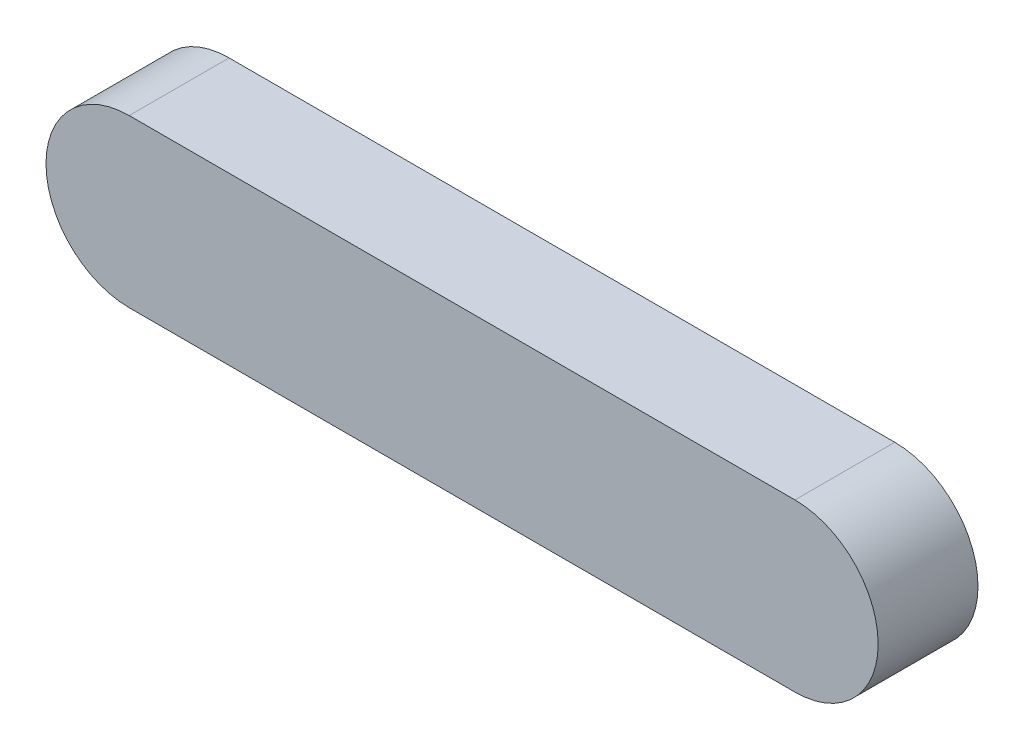
ISO-10303-21;
HEADER;
FILE_DESCRIPTION(('STEP AP214'),'2;1');
FILE_NAME('part.step','',(''),(''),'','','');
FILE_SCHEMA(('AUTOMOTIVE_DESIGN { 1 0 10303 214 1 1 1 1 }'));
ENDSEC;
DATA;
#1=APPLICATION_CONTEXT('core data for automotive mechanical design processes');
#2=APPLICATION_PROTOCOL_DEFINITION('international standard','automotive_design',2000,#1);
#3=PRODUCT_CONTEXT('',#1,'mechanical');
#4=PRODUCT('Part','Part','',(#3));
#5=PRODUCT_RELATED_PRODUCT_CATEGORY('part','',(#4));
#6=PRODUCT_DEFINITION_FORMATION('','',#4);
#7=PRODUCT_DEFINITION_CONTEXT('part definition',#1,'design');
#8=PRODUCT_DEFINITION('design','',#6,#7);
#9=PRODUCT_DEFINITION_SHAPE('','',#8);
#10=(LENGTH_UNIT() NAMED_UNIT(*) SI_UNIT(.MILLI.,.METRE.));
#11=(NAMED_UNIT(*) PLANE_ANGLE_UNIT() SI_UNIT($,.RADIAN.));
#12=(NAMED_UNIT(*) SI_UNIT($,.STERADIAN.) SOLID_ANGLE_UNIT());
#13=UNCERTAINTY_MEASURE_WITH_UNIT(LENGTH_MEASURE(1.E-05),#10,'distance_accuracy_value','');
#14=(GEOMETRIC_REPRESENTATION_CONTEXT(3) GLOBAL_UNCERTAINTY_ASSIGNED_CONTEXT((#13)) GLOBAL_UNIT_ASSIGNED_CONTEXT((#10,
#11,#12)) REPRESENTATION_CONTEXT('',''));
#15=CARTESIAN_POINT('',(0.,0.,0.));
#16=DIRECTION('',(0.,0.,1.));
#17=DIRECTION('',(1.,0.,0.));
#18=AXIS2_PLACEMENT_3D('',#15,#16,#17);
#19=CARTESIAN_POINT('',(0.,0.,6.));
#20=DIRECTION('',(0.,0.,-1.));
#21=DIRECTION('',(-1.,0.,0.));
#22=AXIS2_PLACEMENT_3D('',#19,#20,#21);
#23=CYLINDRICAL_SURFACE('',#22,5.);
#24=CARTESIAN_POINT('',(0.,0.,0.));
#25=DIRECTION('',(0.,0.,1.));
#26=DIRECTION('',(1.,0.,0.));
#27=AXIS2_PLACEMENT_3D('',#24,#25,#26);
#28=CIRCLE('',#27,5.);
#29=CARTESIAN_POINT('',(0.,5.,0.));
#30=VERTEX_POINT('',#29);
#31=CARTESIAN_POINT('',(0.,-5.,0.));
#32=VERTEX_POINT('',#31);
#33=EDGE_CURVE('E107',#30,#32,#28,.T.);
#34=ORIENTED_EDGE('',*,*,#33,.T.);
#35=DIRECTION('',(0.,0.,-1.));
#36=VECTOR('',#35,1.);
#37=CARTESIAN_POINT('',(0.,-5.,6.));
#38=LINE('',#37,#36);
#39=CARTESIAN_POINT('',(0.,-5.,6.));
#40=VERTEX_POINT('',#39);
#41=EDGE_CURVE('E11',#40,#32,#38,.T.);
#42=ORIENTED_EDGE('',*,*,#41,.F.);
#43=CARTESIAN_POINT('',(0.,0.,6.));
#44=DIRECTION('',(0.,0.,1.));
#45=DIRECTION('',(1.,0.,0.));
#46=AXIS2_PLACEMENT_3D('',#43,#44,#45);
#47=CIRCLE('',#46,5.);
#48=CARTESIAN_POINT('',(0.,5.,6.));
#49=VERTEX_POINT('',#48);
#50=EDGE_CURVE('E91',#49,#40,#47,.T.);
#51=ORIENTED_EDGE('',*,*,#50,.F.);
#52=DIRECTION('',(0.,0.,-1.));
#53=VECTOR('',#52,1.);
#54=CARTESIAN_POINT('',(0.,5.,6.));
#55=LINE('',#54,#53);
#56=EDGE_CURVE('E103',#49,#30,#55,.T.);
#57=ORIENTED_EDGE('',*,*,#56,.T.);
#58=EDGE_LOOP('',(#34,#42,#51,#57));
#59=FACE_BOUND('',#58,.T.);
#60=ADVANCED_FACE('F39',(#59),#23,.T.);
#61=CARTESIAN_POINT('',(0.,-5.,6.));
#62=DIRECTION('',(0.,1.,0.));
#63=DIRECTION('',(0.,0.,1.));
#64=AXIS2_PLACEMENT_3D('',#61,#62,#63);
#65=PLANE('',#64);
#66=DIRECTION('',(1.,0.,0.));
#67=VECTOR('',#66,1.);
#68=CARTESIAN_POINT('',(0.,-5.,0.));
#69=LINE('',#68,#67);
#70=CARTESIAN_POINT('',(40.,-5.,0.));
#71=VERTEX_POINT('',#70);
#72=EDGE_CURVE('E96',#32,#71,#69,.T.);
#73=ORIENTED_EDGE('',*,*,#72,.T.);
#74=DIRECTION('',(0.,0.,-1.));
#75=VECTOR('',#74,1.);
#76=CARTESIAN_POINT('',(40.,-5.,6.));
#77=LINE('',#76,#75);
#78=CARTESIAN_POINT('',(40.,-5.,6.));
#79=VERTEX_POINT('',#78);
#80=EDGE_CURVE('E48',#79,#71,#77,.T.);
#81=ORIENTED_EDGE('',*,*,#80,.F.);
#82=DIRECTION('',(1.,0.,0.));
#83=VECTOR('',#82,1.);
#84=CARTESIAN_POINT('',(0.,-5.,6.));
#85=LINE('',#84,#83);
#86=EDGE_CURVE('E86',#40,#79,#85,.T.);
#87=ORIENTED_EDGE('',*,*,#86,.F.);
#88=ORIENTED_EDGE('',*,*,#41,.T.);
#89=EDGE_LOOP('',(#73,#81,#87,#88));
#90=FACE_BOUND('',#89,.T.);
#91=ADVANCED_FACE('F95',(#90),#65,.F.);
#92=CARTESIAN_POINT('',(40.,0.,6.));
#93=DIRECTION('',(0.,0.,-1.));
#94=DIRECTION('',(-1.,0.,0.));
#95=AXIS2_PLACEMENT_3D('',#92,#93,#94);
#96=CYLINDRICAL_SURFACE('',#95,5.);
#97=CARTESIAN_POINT('',(40.,0.,0.));
#98=DIRECTION('',(0.,0.,1.));
#99=DIRECTION('',(1.,0.,0.));
#100=AXIS2_PLACEMENT_3D('',#97,#98,#99);
#101=CIRCLE('',#100,5.);
#102=CARTESIAN_POINT('',(40.,5.,0.));
#103=VERTEX_POINT('',#102);
#104=EDGE_CURVE('E73',#71,#103,#101,.T.);
#105=ORIENTED_EDGE('',*,*,#104,.T.);
#106=DIRECTION('',(0.,0.,-1.));
#107=VECTOR('',#106,1.);
#108=CARTESIAN_POINT('',(40.,5.,6.));
#109=LINE('',#108,#107);
#110=CARTESIAN_POINT('',(40.,5.,6.));
#111=VERTEX_POINT('',#110);
#112=EDGE_CURVE('E98',#111,#103,#109,.T.);
#113=ORIENTED_EDGE('',*,*,#112,.F.);
#114=CARTESIAN_POINT('',(40.,0.,6.));
#115=DIRECTION('',(0.,0.,1.));
#116=DIRECTION('',(1.,0.,0.));
#117=AXIS2_PLACEMENT_3D('',#114,#115,#116);
#118=CIRCLE('',#117,5.);
#119=EDGE_CURVE('E89',#79,#111,#118,.T.);
#120=ORIENTED_EDGE('',*,*,#119,.F.);
#121=ORIENTED_EDGE('',*,*,#80,.T.);
#122=EDGE_LOOP('',(#105,#113,#120,#121));
#123=FACE_BOUND('',#122,.T.);
#124=ADVANCED_FACE('F99',(#123),#96,.T.);
#125=CARTESIAN_POINT('',(0.,5.,6.));
#126=DIRECTION('',(0.,-1.,0.));
#127=DIRECTION('',(0.,0.,-1.));
#128=AXIS2_PLACEMENT_3D('',#125,#126,#127);
#129=PLANE('',#128);
#130=DIRECTION('',(-1.,0.,0.));
#131=VECTOR('',#130,1.);
#132=CARTESIAN_POINT('',(0.,5.,0.));
#133=LINE('',#132,#131);
#134=EDGE_CURVE('E79',#103,#30,#133,.T.);
#135=ORIENTED_EDGE('',*,*,#134,.T.);
#136=ORIENTED_EDGE('',*,*,#56,.F.);
#137=DIRECTION('',(-1.,0.,0.));
#138=VECTOR('',#137,1.);
#139=CARTESIAN_POINT('',(0.,5.,6.));
#140=LINE('',#139,#138);
#141=EDGE_CURVE('E56',#111,#49,#140,.T.);
#142=ORIENTED_EDGE('',*,*,#141,.F.);
#143=ORIENTED_EDGE('',*,*,#112,.T.);
#144=EDGE_LOOP('',(#135,#136,#142,#143));
#145=FACE_BOUND('',#144,.T.);
#146=ADVANCED_FACE('F120',(#145),#129,.F.);
#147=CARTESIAN_POINT('',(0.,0.,6.));
#148=DIRECTION('',(0.,0.,1.));
#149=DIRECTION('',(1.,0.,0.));
#150=AXIS2_PLACEMENT_3D('',#147,#148,#149);
#151=PLANE('',#150);
#152=ORIENTED_EDGE('',*,*,#50,.T.);
#153=ORIENTED_EDGE('',*,*,#86,.T.);
#154=ORIENTED_EDGE('',*,*,#119,.T.);
#155=ORIENTED_EDGE('',*,*,#141,.T.);
#156=EDGE_LOOP('',(#152,#153,#154,#155));
#157=FACE_BOUND('',#156,.T.);
#158=ADVANCED_FACE('F87',(#157),#151,.T.);
#159=CARTESIAN_POINT('',(0.,0.,0.));
#160=DIRECTION('',(0.,0.,1.));
#161=DIRECTION('',(1.,0.,0.));
#162=AXIS2_PLACEMENT_3D('',#159,#160,#161);
#163=PLANE('',#162);
#164=ORIENTED_EDGE('',*,*,#33,.F.);
#165=ORIENTED_EDGE('',*,*,#134,.F.);
#166=ORIENTED_EDGE('',*,*,#104,.F.);
#167=ORIENTED_EDGE('',*,*,#72,.F.);
#168=EDGE_LOOP('',(#164,#165,#166,#167));
#169=FACE_BOUND('',#168,.T.);
#170=ADVANCED_FACE('F123',(#169),#163,.F.);
#171=CLOSED_SHELL('',(#60,#91,#124,#146,#158,#170));
#172=MANIFOLD_SOLID_BREP('B2',#171);
#173=ADVANCED_BREP_SHAPE_REPRESENTATION('',(#18,#172),#14);
#174=SHAPE_DEFINITION_REPRESENTATION(#9,#173);
ENDSEC;
END-ISO-10303-21;
